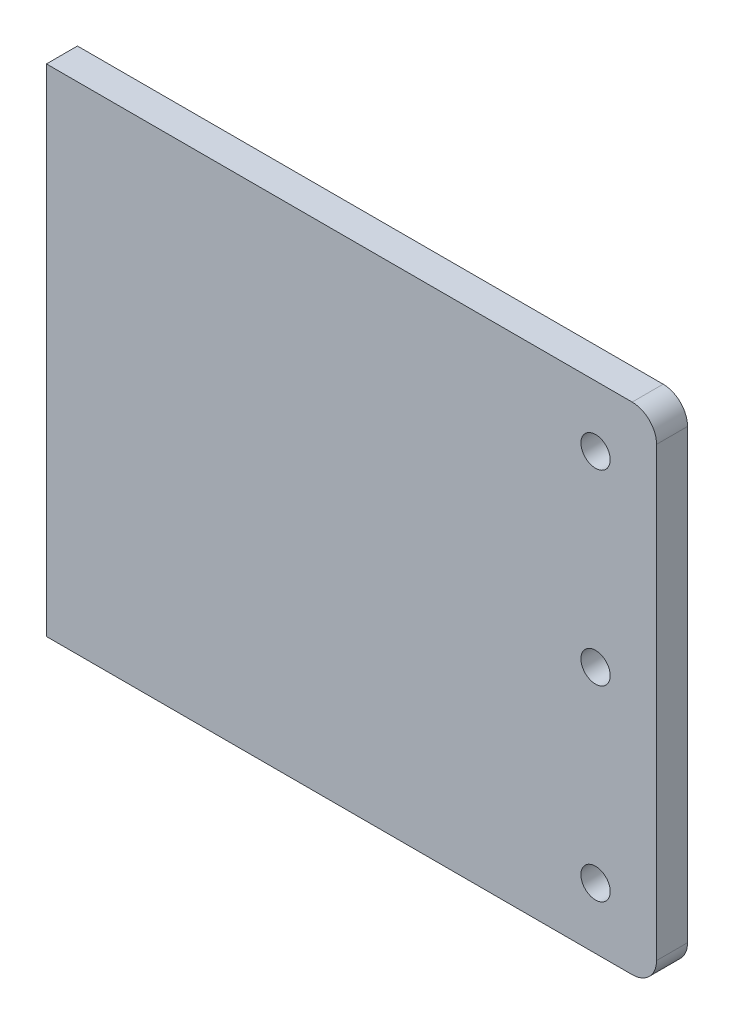
ISO-10303-21;
HEADER;
FILE_DESCRIPTION(('STEP AP214'),'2;1');
FILE_NAME('part.step','',(''),(''),'','','');
FILE_SCHEMA(('AUTOMOTIVE_DESIGN { 1 0 10303 214 1 1 1 1 }'));
ENDSEC;
DATA;
#1=APPLICATION_CONTEXT('core data for automotive mechanical design processes');
#2=APPLICATION_PROTOCOL_DEFINITION('international standard','automotive_design',2000,#1);
#3=PRODUCT_CONTEXT('',#1,'mechanical');
#4=PRODUCT('Part','Part','',(#3));
#5=PRODUCT_RELATED_PRODUCT_CATEGORY('part','',(#4));
#6=PRODUCT_DEFINITION_FORMATION('','',#4);
#7=PRODUCT_DEFINITION_CONTEXT('part definition',#1,'design');
#8=PRODUCT_DEFINITION('design','',#6,#7);
#9=PRODUCT_DEFINITION_SHAPE('','',#8);
#10=(LENGTH_UNIT() NAMED_UNIT(*) SI_UNIT(.MILLI.,.METRE.));
#11=(NAMED_UNIT(*) PLANE_ANGLE_UNIT() SI_UNIT($,.RADIAN.));
#12=(NAMED_UNIT(*) SI_UNIT($,.STERADIAN.) SOLID_ANGLE_UNIT());
#13=UNCERTAINTY_MEASURE_WITH_UNIT(LENGTH_MEASURE(1.E-05),#10,'distance_accuracy_value','');
#14=(GEOMETRIC_REPRESENTATION_CONTEXT(3) GLOBAL_UNCERTAINTY_ASSIGNED_CONTEXT((#13)) GLOBAL_UNIT_ASSIGNED_CONTEXT((#10,
#11,#12)) REPRESENTATION_CONTEXT('',''));
#15=CARTESIAN_POINT('',(0.,0.,0.));
#16=DIRECTION('',(0.,0.,1.));
#17=DIRECTION('',(1.,0.,0.));
#18=AXIS2_PLACEMENT_3D('',#15,#16,#17);
#19=CARTESIAN_POINT('',(-50.,0.,0.));
#20=DIRECTION('',(-1.,0.,0.));
#21=DIRECTION('',(0.,0.,1.));
#22=AXIS2_PLACEMENT_3D('',#19,#20,#21);
#23=PLANE('',#22);
#24=DIRECTION('',(0.,0.,1.));
#25=VECTOR('',#24,1.);
#26=CARTESIAN_POINT('',(-50.,102.,0.));
#27=LINE('',#26,#25);
#28=CARTESIAN_POINT('',(-50.,102.,-44.4542024237734));
#29=VERTEX_POINT('',#28);
#30=CARTESIAN_POINT('',(-50.,102.,-38.1042024237733));
#31=VERTEX_POINT('',#30);
#32=EDGE_CURVE('E40',#29,#31,#27,.T.);
#33=ORIENTED_EDGE('',*,*,#32,.T.);
#34=DIRECTION('',(0.,1.,0.));
#35=VECTOR('',#34,1.);
#36=CARTESIAN_POINT('',(-50.,0.,-38.1042024237733));
#37=LINE('',#36,#35);
#38=CARTESIAN_POINT('',(-50.,203.6,-38.1042024237733));
#39=VERTEX_POINT('',#38);
#40=EDGE_CURVE('E11',#31,#39,#37,.T.);
#41=ORIENTED_EDGE('',*,*,#40,.T.);
#42=DIRECTION('',(0.,0.,1.));
#43=VECTOR('',#42,1.);
#44=CARTESIAN_POINT('',(-50.,203.6,-21.9542024237733));
#45=LINE('',#44,#43);
#46=CARTESIAN_POINT('',(-50.,203.6,-44.4542024237733));
#47=VERTEX_POINT('',#46);
#48=EDGE_CURVE('E105',#47,#39,#45,.T.);
#49=ORIENTED_EDGE('',*,*,#48,.F.);
#50=DIRECTION('',(0.,1.,0.));
#51=VECTOR('',#50,1.);
#52=CARTESIAN_POINT('',(-50.,203.6,-44.4542024237733));
#53=LINE('',#52,#51);
#54=EDGE_CURVE('E106',#29,#47,#53,.T.);
#55=ORIENTED_EDGE('',*,*,#54,.F.);
#56=EDGE_LOOP('',(#33,#41,#49,#55));
#57=FACE_BOUND('',#56,.T.);
#58=ADVANCED_FACE('F36',(#57),#23,.T.);
#59=CARTESIAN_POINT('',(75.,0.,0.));
#60=DIRECTION('',(-1.,0.,0.));
#61=DIRECTION('',(0.,0.,1.));
#62=AXIS2_PLACEMENT_3D('',#59,#60,#61);
#63=PLANE('',#62);
#64=DIRECTION('',(0.,-1.,0.));
#65=VECTOR('',#64,1.);
#66=CARTESIAN_POINT('',(75.,203.6,-38.1042024237733));
#67=LINE('',#66,#65);
#68=CARTESIAN_POINT('',(75.,198.6,-38.1042024237733));
#69=VERTEX_POINT('',#68);
#70=CARTESIAN_POINT('',(75.,107.,-38.1042024237733));
#71=VERTEX_POINT('',#70);
#72=EDGE_CURVE('E91',#69,#71,#67,.T.);
#73=ORIENTED_EDGE('',*,*,#72,.T.);
#74=DIRECTION('',(0.,0.,-1.));
#75=VECTOR('',#74,1.);
#76=CARTESIAN_POINT('',(75.,107.,0.));
#77=LINE('',#76,#75);
#78=CARTESIAN_POINT('',(75.,107.,-44.4542024237733));
#79=VERTEX_POINT('',#78);
#80=EDGE_CURVE('E118',#71,#79,#77,.T.);
#81=ORIENTED_EDGE('',*,*,#80,.T.);
#82=DIRECTION('',(0.,1.,0.));
#83=VECTOR('',#82,1.);
#84=CARTESIAN_POINT('',(75.,203.6,-44.4542024237733));
#85=LINE('',#84,#83);
#86=CARTESIAN_POINT('',(75.,198.6,-44.4542024237733));
#87=VERTEX_POINT('',#86);
#88=EDGE_CURVE('E132',#79,#87,#85,.T.);
#89=ORIENTED_EDGE('',*,*,#88,.T.);
#90=DIRECTION('',(0.,0.,1.));
#91=VECTOR('',#90,1.);
#92=CARTESIAN_POINT('',(75.,198.6,2.44989214100618E-13));
#93=LINE('',#92,#91);
#94=EDGE_CURVE('E121',#87,#69,#93,.T.);
#95=ORIENTED_EDGE('',*,*,#94,.T.);
#96=EDGE_LOOP('',(#73,#81,#89,#95));
#97=FACE_BOUND('',#96,.T.);
#98=ADVANCED_FACE('F164',(#97),#63,.F.);
#99=CARTESIAN_POINT('',(50.,203.6,-44.4542024237733));
#100=DIRECTION('',(0.,0.,1.));
#101=DIRECTION('',(0.,-1.,0.));
#102=AXIS2_PLACEMENT_3D('',#99,#100,#101);
#103=PLANE('',#102);
#104=CARTESIAN_POINT('',(62.5,114.5,-44.4542024237734));
#105=DIRECTION('',(0.,0.,1.));
#106=DIRECTION('',(0.,-1.,0.));
#107=AXIS2_PLACEMENT_3D('',#104,#105,#106);
#108=CIRCLE('',#107,3.00000000000001);
#109=CARTESIAN_POINT('',(62.5,111.5,-44.4542024237734));
#110=VERTEX_POINT('',#109);
#111=EDGE_CURVE('E135',#110,#110,#108,.T.);
#112=ORIENTED_EDGE('',*,*,#111,.T.);
#113=EDGE_LOOP('',(#112));
#114=FACE_BOUND('',#113,.T.);
#115=CARTESIAN_POINT('',(62.5,191.1,-44.4542024237733));
#116=DIRECTION('',(0.,0.,1.));
#117=DIRECTION('',(0.,-1.,0.));
#118=AXIS2_PLACEMENT_3D('',#115,#116,#117);
#119=CIRCLE('',#118,3.00000000000001);
#120=CARTESIAN_POINT('',(62.5,188.1,-44.4542024237733));
#121=VERTEX_POINT('',#120);
#122=EDGE_CURVE('E141',#121,#121,#119,.T.);
#123=ORIENTED_EDGE('',*,*,#122,.T.);
#124=EDGE_LOOP('',(#123));
#125=FACE_BOUND('',#124,.T.);
#126=CARTESIAN_POINT('',(62.5,152.8,-44.4542024237733));
#127=DIRECTION('',(0.,0.,1.));
#128=DIRECTION('',(0.,-1.,0.));
#129=AXIS2_PLACEMENT_3D('',#126,#127,#128);
#130=CIRCLE('',#129,3.00000000000001);
#131=CARTESIAN_POINT('',(62.5,149.8,-44.4542024237733));
#132=VERTEX_POINT('',#131);
#133=EDGE_CURVE('E147',#132,#132,#130,.T.);
#134=ORIENTED_EDGE('',*,*,#133,.T.);
#135=EDGE_LOOP('',(#134));
#136=FACE_BOUND('',#135,.T.);
#137=ORIENTED_EDGE('',*,*,#88,.F.);
#138=CARTESIAN_POINT('',(70.,107.,-44.4542024237734));
#139=DIRECTION('',(0.,0.,1.));
#140=DIRECTION('',(0.,-1.,0.));
#141=AXIS2_PLACEMENT_3D('',#138,#139,#140);
#142=CIRCLE('',#141,5.);
#143=CARTESIAN_POINT('',(70.,102.,-44.4542024237733));
#144=VERTEX_POINT('',#143);
#145=EDGE_CURVE('E115',#79,#144,#142,.F.);
#146=ORIENTED_EDGE('',*,*,#145,.T.);
#147=DIRECTION('',(-1.,0.,0.));
#148=VECTOR('',#147,1.);
#149=CARTESIAN_POINT('',(75.,102.,-44.4542024237733));
#150=LINE('',#149,#148);
#151=EDGE_CURVE('E129',#144,#29,#150,.T.);
#152=ORIENTED_EDGE('',*,*,#151,.T.);
#153=ORIENTED_EDGE('',*,*,#54,.T.);
#154=DIRECTION('',(-1.,0.,0.));
#155=VECTOR('',#154,1.);
#156=CARTESIAN_POINT('',(50.,203.6,-44.4542024237733));
#157=LINE('',#156,#155);
#158=CARTESIAN_POINT('',(70.,203.6,-44.4542024237733));
#159=VERTEX_POINT('',#158);
#160=EDGE_CURVE('E123',#159,#47,#157,.T.);
#161=ORIENTED_EDGE('',*,*,#160,.F.);
#162=CARTESIAN_POINT('',(70.,198.6,-44.4542024237733));
#163=DIRECTION('',(0.,0.,1.));
#164=DIRECTION('',(0.,-1.,0.));
#165=AXIS2_PLACEMENT_3D('',#162,#163,#164);
#166=CIRCLE('',#165,5.);
#167=EDGE_CURVE('E110',#159,#87,#166,.F.);
#168=ORIENTED_EDGE('',*,*,#167,.T.);
#169=EDGE_LOOP('',(#137,#146,#152,#153,#161,#168));
#170=FACE_BOUND('',#169,.T.);
#171=ADVANCED_FACE('F166',(#114,#125,#136,#170),#103,.F.);
#172=CARTESIAN_POINT('',(62.5,114.5,-143.154202423773));
#173=DIRECTION('',(0.,0.,1.));
#174=DIRECTION('',(1.,0.,0.));
#175=AXIS2_PLACEMENT_3D('',#172,#173,#174);
#176=CYLINDRICAL_SURFACE('',#175,3.00000000000001);
#177=CARTESIAN_POINT('',(62.5,114.5,-38.1042024237733));
#178=DIRECTION('',(0.,0.,-1.));
#179=DIRECTION('',(0.,1.,0.));
#180=AXIS2_PLACEMENT_3D('',#177,#178,#179);
#181=CIRCLE('',#180,3.00000000000001);
#182=CARTESIAN_POINT('',(62.5,117.5,-38.1042024237733));
#183=VERTEX_POINT('',#182);
#184=EDGE_CURVE('E138',#183,#183,#181,.T.);
#185=ORIENTED_EDGE('',*,*,#184,.F.);
#186=EDGE_LOOP('',(#185));
#187=FACE_BOUND('',#186,.T.);
#188=ORIENTED_EDGE('',*,*,#111,.F.);
#189=EDGE_LOOP('',(#188));
#190=FACE_BOUND('',#189,.T.);
#191=ADVANCED_FACE('F183',(#187,#190),#176,.F.);
#192=CARTESIAN_POINT('',(62.5,191.1,-143.154202423773));
#193=DIRECTION('',(0.,0.,1.));
#194=DIRECTION('',(1.,0.,0.));
#195=AXIS2_PLACEMENT_3D('',#192,#193,#194);
#196=CYLINDRICAL_SURFACE('',#195,3.00000000000001);
#197=CARTESIAN_POINT('',(62.5,191.1,-38.1042024237733));
#198=DIRECTION('',(0.,0.,-1.));
#199=DIRECTION('',(0.,1.,0.));
#200=AXIS2_PLACEMENT_3D('',#197,#198,#199);
#201=CIRCLE('',#200,3.00000000000001);
#202=CARTESIAN_POINT('',(62.5,194.1,-38.1042024237733));
#203=VERTEX_POINT('',#202);
#204=EDGE_CURVE('E144',#203,#203,#201,.T.);
#205=ORIENTED_EDGE('',*,*,#204,.F.);
#206=EDGE_LOOP('',(#205));
#207=FACE_BOUND('',#206,.T.);
#208=ORIENTED_EDGE('',*,*,#122,.F.);
#209=EDGE_LOOP('',(#208));
#210=FACE_BOUND('',#209,.T.);
#211=ADVANCED_FACE('F38',(#207,#210),#196,.F.);
#212=CARTESIAN_POINT('',(62.5,152.8,-143.154202423773));
#213=DIRECTION('',(0.,0.,1.));
#214=DIRECTION('',(1.,0.,0.));
#215=AXIS2_PLACEMENT_3D('',#212,#213,#214);
#216=CYLINDRICAL_SURFACE('',#215,3.00000000000001);
#217=CARTESIAN_POINT('',(62.5,152.8,-38.1042024237733));
#218=DIRECTION('',(0.,0.,-1.));
#219=DIRECTION('',(0.,1.,0.));
#220=AXIS2_PLACEMENT_3D('',#217,#218,#219);
#221=CIRCLE('',#220,3.00000000000001);
#222=CARTESIAN_POINT('',(62.5,155.8,-38.1042024237733));
#223=VERTEX_POINT('',#222);
#224=EDGE_CURVE('E150',#223,#223,#221,.T.);
#225=ORIENTED_EDGE('',*,*,#224,.F.);
#226=EDGE_LOOP('',(#225));
#227=FACE_BOUND('',#226,.T.);
#228=ORIENTED_EDGE('',*,*,#133,.F.);
#229=EDGE_LOOP('',(#228));
#230=FACE_BOUND('',#229,.T.);
#231=ADVANCED_FACE('F180',(#227,#230),#216,.F.);
#232=CARTESIAN_POINT('',(70.,198.6,2.44989214100618E-13));
#233=DIRECTION('',(0.,0.,1.));
#234=DIRECTION('',(0.,-1.,0.));
#235=AXIS2_PLACEMENT_3D('',#232,#233,#234);
#236=CYLINDRICAL_SURFACE('',#235,5.);
#237=ORIENTED_EDGE('',*,*,#167,.F.);
#238=DIRECTION('',(0.,0.,1.));
#239=VECTOR('',#238,1.);
#240=CARTESIAN_POINT('',(70.,203.6,-21.9542024237733));
#241=LINE('',#240,#239);
#242=CARTESIAN_POINT('',(70.,203.6,-38.1042024237733));
#243=VERTEX_POINT('',#242);
#244=EDGE_CURVE('E102',#243,#159,#241,.F.);
#245=ORIENTED_EDGE('',*,*,#244,.F.);
#246=CARTESIAN_POINT('',(70.,198.6,-38.1042024237733));
#247=DIRECTION('',(0.,0.,-1.));
#248=DIRECTION('',(0.,1.,0.));
#249=AXIS2_PLACEMENT_3D('',#246,#247,#248);
#250=CIRCLE('',#249,5.);
#251=EDGE_CURVE('E88',#69,#243,#250,.F.);
#252=ORIENTED_EDGE('',*,*,#251,.F.);
#253=ORIENTED_EDGE('',*,*,#94,.F.);
#254=EDGE_LOOP('',(#237,#245,#252,#253));
#255=FACE_BOUND('',#254,.T.);
#256=ADVANCED_FACE('F109',(#255),#236,.T.);
#257=CARTESIAN_POINT('',(70.,107.,0.));
#258=DIRECTION('',(0.,0.,-1.));
#259=DIRECTION('',(-1.,0.,0.));
#260=AXIS2_PLACEMENT_3D('',#257,#258,#259);
#261=CYLINDRICAL_SURFACE('',#260,5.);
#262=CARTESIAN_POINT('',(70.,107.,-38.1042024237733));
#263=DIRECTION('',(0.,0.,-1.));
#264=DIRECTION('',(0.,1.,0.));
#265=AXIS2_PLACEMENT_3D('',#262,#263,#264);
#266=CIRCLE('',#265,5.);
#267=CARTESIAN_POINT('',(70.,102.,-38.1042024237733));
#268=VERTEX_POINT('',#267);
#269=EDGE_CURVE('E97',#268,#71,#266,.F.);
#270=ORIENTED_EDGE('',*,*,#269,.F.);
#271=DIRECTION('',(0.,0.,-1.));
#272=VECTOR('',#271,1.);
#273=CARTESIAN_POINT('',(70.,102.,-44.4542024237733));
#274=LINE('',#273,#272);
#275=EDGE_CURVE('E96',#144,#268,#274,.F.);
#276=ORIENTED_EDGE('',*,*,#275,.F.);
#277=ORIENTED_EDGE('',*,*,#145,.F.);
#278=ORIENTED_EDGE('',*,*,#80,.F.);
#279=EDGE_LOOP('',(#270,#276,#277,#278));
#280=FACE_BOUND('',#279,.T.);
#281=ADVANCED_FACE('F161',(#280),#261,.T.);
#282=CARTESIAN_POINT('',(75.,203.6,-38.1042024237733));
#283=DIRECTION('',(0.,0.,-1.));
#284=DIRECTION('',(0.,1.,0.));
#285=AXIS2_PLACEMENT_3D('',#282,#283,#284);
#286=PLANE('',#285);
#287=ORIENTED_EDGE('',*,*,#184,.T.);
#288=EDGE_LOOP('',(#287));
#289=FACE_BOUND('',#288,.T.);
#290=ORIENTED_EDGE('',*,*,#204,.T.);
#291=EDGE_LOOP('',(#290));
#292=FACE_BOUND('',#291,.T.);
#293=ORIENTED_EDGE('',*,*,#224,.T.);
#294=EDGE_LOOP('',(#293));
#295=FACE_BOUND('',#294,.T.);
#296=DIRECTION('',(-1.,0.,0.));
#297=VECTOR('',#296,1.);
#298=CARTESIAN_POINT('',(75.,102.,-38.1042024237733));
#299=LINE('',#298,#297);
#300=EDGE_CURVE('E51',#268,#31,#299,.T.);
#301=ORIENTED_EDGE('',*,*,#300,.F.);
#302=ORIENTED_EDGE('',*,*,#269,.T.);
#303=ORIENTED_EDGE('',*,*,#72,.F.);
#304=ORIENTED_EDGE('',*,*,#251,.T.);
#305=DIRECTION('',(-1.,0.,0.));
#306=VECTOR('',#305,1.);
#307=CARTESIAN_POINT('',(75.,203.6,-38.1042024237733));
#308=LINE('',#307,#306);
#309=EDGE_CURVE('E59',#243,#39,#308,.T.);
#310=ORIENTED_EDGE('',*,*,#309,.T.);
#311=ORIENTED_EDGE('',*,*,#40,.F.);
#312=EDGE_LOOP('',(#301,#302,#303,#304,#310,#311));
#313=FACE_BOUND('',#312,.T.);
#314=ADVANCED_FACE('F89',(#289,#292,#295,#313),#286,.F.);
#315=CARTESIAN_POINT('',(50.,203.6,-21.9542024237733));
#316=DIRECTION('',(0.,-1.,0.));
#317=DIRECTION('',(0.,0.,-1.));
#318=AXIS2_PLACEMENT_3D('',#315,#316,#317);
#319=PLANE('',#318);
#320=ORIENTED_EDGE('',*,*,#48,.T.);
#321=ORIENTED_EDGE('',*,*,#309,.F.);
#322=ORIENTED_EDGE('',*,*,#244,.T.);
#323=ORIENTED_EDGE('',*,*,#160,.T.);
#324=EDGE_LOOP('',(#320,#321,#322,#323));
#325=FACE_BOUND('',#324,.T.);
#326=ADVANCED_FACE('F101',(#325),#319,.F.);
#327=CARTESIAN_POINT('',(75.,102.,-44.4542024237733));
#328=DIRECTION('',(0.,1.,0.));
#329=DIRECTION('',(0.,0.,1.));
#330=AXIS2_PLACEMENT_3D('',#327,#328,#329);
#331=PLANE('',#330);
#332=ORIENTED_EDGE('',*,*,#151,.F.);
#333=ORIENTED_EDGE('',*,*,#275,.T.);
#334=ORIENTED_EDGE('',*,*,#300,.T.);
#335=ORIENTED_EDGE('',*,*,#32,.F.);
#336=EDGE_LOOP('',(#332,#333,#334,#335));
#337=FACE_BOUND('',#336,.T.);
#338=ADVANCED_FACE('F167',(#337),#331,.F.);
#339=CLOSED_SHELL('',(#58,#98,#171,#191,#211,#231,#256,#281,#314,#326,#338));
#340=MANIFOLD_SOLID_BREP('B2',#339);
#341=ADVANCED_BREP_SHAPE_REPRESENTATION('',(#18,#340),#14);
#342=SHAPE_DEFINITION_REPRESENTATION(#9,#341);
ENDSEC;
END-ISO-10303-21;
